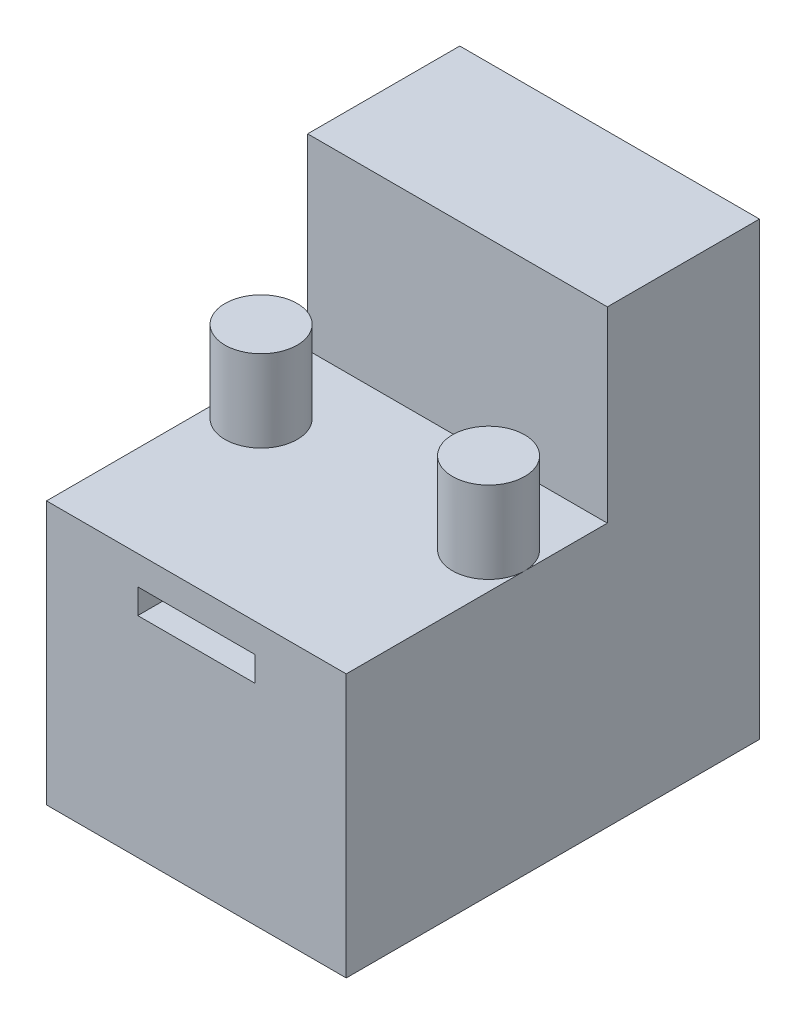
ISO-10303-21;
HEADER;
FILE_DESCRIPTION(('STEP AP214'),'2;1');
FILE_NAME('part.step','',(''),(''),'','','');
FILE_SCHEMA(('AUTOMOTIVE_DESIGN { 1 0 10303 214 1 1 1 1 }'));
ENDSEC;
DATA;
#1=APPLICATION_CONTEXT('core data for automotive mechanical design processes');
#2=APPLICATION_PROTOCOL_DEFINITION('international standard','automotive_design',2000,#1);
#3=PRODUCT_CONTEXT('',#1,'mechanical');
#4=PRODUCT('Part','Part','',(#3));
#5=PRODUCT_RELATED_PRODUCT_CATEGORY('part','',(#4));
#6=PRODUCT_DEFINITION_FORMATION('','',#4);
#7=PRODUCT_DEFINITION_CONTEXT('part definition',#1,'design');
#8=PRODUCT_DEFINITION('design','',#6,#7);
#9=PRODUCT_DEFINITION_SHAPE('','',#8);
#10=(LENGTH_UNIT() NAMED_UNIT(*) SI_UNIT(.MILLI.,.METRE.));
#11=(NAMED_UNIT(*) PLANE_ANGLE_UNIT() SI_UNIT($,.RADIAN.));
#12=(NAMED_UNIT(*) SI_UNIT($,.STERADIAN.) SOLID_ANGLE_UNIT());
#13=UNCERTAINTY_MEASURE_WITH_UNIT(LENGTH_MEASURE(1.E-05),#10,'distance_accuracy_value','');
#14=(GEOMETRIC_REPRESENTATION_CONTEXT(3) GLOBAL_UNCERTAINTY_ASSIGNED_CONTEXT((#13)) GLOBAL_UNIT_ASSIGNED_CONTEXT((#10,
#11,#12)) REPRESENTATION_CONTEXT('',''));
#15=CARTESIAN_POINT('',(0.,0.,0.));
#16=DIRECTION('',(0.,0.,1.));
#17=DIRECTION('',(1.,0.,0.));
#18=AXIS2_PLACEMENT_3D('',#15,#16,#17);
#19=CARTESIAN_POINT('',(0.,11.6,0.));
#20=DIRECTION('',(0.,1.,0.));
#21=DIRECTION('',(0.,0.,1.));
#22=AXIS2_PLACEMENT_3D('',#19,#20,#21);
#23=PLANE('',#22);
#24=DIRECTION('',(0.,0.,-1.));
#25=VECTOR('',#24,1.);
#26=CARTESIAN_POINT('',(6.6,11.6,-9.1));
#27=LINE('',#26,#25);
#28=CARTESIAN_POINT('',(6.6,11.6,1.24));
#29=VERTEX_POINT('',#28);
#30=CARTESIAN_POINT('',(6.6,11.6,-2.4));
#31=VERTEX_POINT('',#30);
#32=EDGE_CURVE('E188',#29,#31,#27,.T.);
#33=ORIENTED_EDGE('',*,*,#32,.T.);
#34=DIRECTION('',(1.,0.,0.));
#35=VECTOR('',#34,1.);
#36=CARTESIAN_POINT('',(-6.6,11.6,-2.4));
#37=LINE('',#36,#35);
#38=CARTESIAN_POINT('',(-6.6,11.6,-2.4));
#39=VERTEX_POINT('',#38);
#40=EDGE_CURVE('E56',#39,#31,#37,.T.);
#41=ORIENTED_EDGE('',*,*,#40,.F.);
#42=DIRECTION('',(0.,0.,1.));
#43=VECTOR('',#42,1.);
#44=CARTESIAN_POINT('',(-6.6,11.6,-9.1));
#45=LINE('',#44,#43);
#46=CARTESIAN_POINT('',(-6.6,11.6,1.24));
#47=VERTEX_POINT('',#46);
#48=EDGE_CURVE('E189',#39,#47,#45,.T.);
#49=ORIENTED_EDGE('',*,*,#48,.T.);
#50=CARTESIAN_POINT('',(-5.01,11.6,1.24));
#51=DIRECTION('',(0.,1.,0.));
#52=DIRECTION('',(0.,0.,1.));
#53=AXIS2_PLACEMENT_3D('',#50,#51,#52);
#54=CIRCLE('',#53,1.59);
#55=EDGE_CURVE('E176',#47,#47,#54,.T.);
#56=ORIENTED_EDGE('',*,*,#55,.F.);
#57=CARTESIAN_POINT('',(-6.6,11.6,9.1));
#58=VERTEX_POINT('',#57);
#59=EDGE_CURVE('E187',#47,#58,#45,.T.);
#60=ORIENTED_EDGE('',*,*,#59,.T.);
#61=DIRECTION('',(1.,0.,0.));
#62=VECTOR('',#61,1.);
#63=CARTESIAN_POINT('',(-6.6,11.6,9.1));
#64=LINE('',#63,#62);
#65=CARTESIAN_POINT('',(6.6,11.6,9.1));
#66=VERTEX_POINT('',#65);
#67=EDGE_CURVE('E191',#58,#66,#64,.T.);
#68=ORIENTED_EDGE('',*,*,#67,.T.);
#69=EDGE_CURVE('E185',#66,#29,#27,.T.);
#70=ORIENTED_EDGE('',*,*,#69,.T.);
#71=CARTESIAN_POINT('',(5.01,11.6,1.24));
#72=DIRECTION('',(0.,-1.,0.));
#73=DIRECTION('',(0.,0.,1.));
#74=AXIS2_PLACEMENT_3D('',#71,#72,#73);
#75=CIRCLE('',#74,1.59);
#76=EDGE_CURVE('E172',#29,#29,#75,.T.);
#77=ORIENTED_EDGE('',*,*,#76,.T.);
#78=EDGE_LOOP('',(#33,#41,#49,#56,#60,#68,#70,#77));
#79=FACE_BOUND('',#78,.T.);
#80=ADVANCED_FACE('F33',(#79),#23,.T.);
#81=CARTESIAN_POINT('',(6.6,11.6,-9.1));
#82=DIRECTION('',(-1.,0.,0.));
#83=DIRECTION('',(0.,0.,1.));
#84=AXIS2_PLACEMENT_3D('',#81,#82,#83);
#85=PLANE('',#84);
#86=DIRECTION('',(0.,0.,-1.));
#87=VECTOR('',#86,1.);
#88=CARTESIAN_POINT('',(6.6,0.,-9.1));
#89=LINE('',#88,#87);
#90=CARTESIAN_POINT('',(6.6,0.,9.1));
#91=VERTEX_POINT('',#90);
#92=CARTESIAN_POINT('',(6.6,0.,-9.1));
#93=VERTEX_POINT('',#92);
#94=EDGE_CURVE('E182',#91,#93,#89,.T.);
#95=ORIENTED_EDGE('',*,*,#94,.T.);
#96=DIRECTION('',(0.,-1.,0.));
#97=VECTOR('',#96,1.);
#98=CARTESIAN_POINT('',(6.6,11.6,-9.1));
#99=LINE('',#98,#97);
#100=CARTESIAN_POINT('',(6.6,19.85,-9.1));
#101=VERTEX_POINT('',#100);
#102=EDGE_CURVE('E11',#101,#93,#99,.T.);
#103=ORIENTED_EDGE('',*,*,#102,.F.);
#104=DIRECTION('',(0.,0.,-1.));
#105=VECTOR('',#104,1.);
#106=CARTESIAN_POINT('',(6.6,19.85,-9.1));
#107=LINE('',#106,#105);
#108=CARTESIAN_POINT('',(6.6,19.85,-2.4));
#109=VERTEX_POINT('',#108);
#110=EDGE_CURVE('E159',#109,#101,#107,.T.);
#111=ORIENTED_EDGE('',*,*,#110,.F.);
#112=DIRECTION('',(0.,-1.,0.));
#113=VECTOR('',#112,1.);
#114=CARTESIAN_POINT('',(6.6,19.85,-2.4));
#115=LINE('',#114,#113);
#116=EDGE_CURVE('E165',#109,#31,#115,.T.);
#117=ORIENTED_EDGE('',*,*,#116,.T.);
#118=ORIENTED_EDGE('',*,*,#32,.F.);
#119=ORIENTED_EDGE('',*,*,#69,.F.);
#120=DIRECTION('',(0.,-1.,0.));
#121=VECTOR('',#120,1.);
#122=CARTESIAN_POINT('',(6.6,11.6,9.1));
#123=LINE('',#122,#121);
#124=EDGE_CURVE('E193',#66,#91,#123,.T.);
#125=ORIENTED_EDGE('',*,*,#124,.T.);
#126=EDGE_LOOP('',(#95,#103,#111,#117,#118,#119,#125));
#127=FACE_BOUND('',#126,.T.);
#128=ADVANCED_FACE('F35',(#127),#85,.F.);
#129=CARTESIAN_POINT('',(-6.6,11.6,-9.1));
#130=DIRECTION('',(0.,0.,1.));
#131=DIRECTION('',(1.,0.,0.));
#132=AXIS2_PLACEMENT_3D('',#129,#130,#131);
#133=PLANE('',#132);
#134=DIRECTION('',(-1.,0.,0.));
#135=VECTOR('',#134,1.);
#136=CARTESIAN_POINT('',(-6.6,0.,-9.1));
#137=LINE('',#136,#135);
#138=CARTESIAN_POINT('',(-6.6,0.,-9.1));
#139=VERTEX_POINT('',#138);
#140=EDGE_CURVE('E196',#93,#139,#137,.T.);
#141=ORIENTED_EDGE('',*,*,#140,.T.);
#142=DIRECTION('',(0.,-1.,0.));
#143=VECTOR('',#142,1.);
#144=CARTESIAN_POINT('',(-6.6,11.6,-9.1));
#145=LINE('',#144,#143);
#146=CARTESIAN_POINT('',(-6.6,19.85,-9.1));
#147=VERTEX_POINT('',#146);
#148=EDGE_CURVE('E41',#147,#139,#145,.T.);
#149=ORIENTED_EDGE('',*,*,#148,.F.);
#150=DIRECTION('',(-1.,0.,0.));
#151=VECTOR('',#150,1.);
#152=CARTESIAN_POINT('',(-6.6,19.85,-9.1));
#153=LINE('',#152,#151);
#154=EDGE_CURVE('E162',#101,#147,#153,.T.);
#155=ORIENTED_EDGE('',*,*,#154,.F.);
#156=ORIENTED_EDGE('',*,*,#102,.T.);
#157=EDGE_LOOP('',(#141,#149,#155,#156));
#158=FACE_BOUND('',#157,.T.);
#159=ADVANCED_FACE('F235',(#158),#133,.F.);
#160=CARTESIAN_POINT('',(-6.6,11.6,-9.1));
#161=DIRECTION('',(1.,0.,0.));
#162=DIRECTION('',(0.,0.,-1.));
#163=AXIS2_PLACEMENT_3D('',#160,#161,#162);
#164=PLANE('',#163);
#165=DIRECTION('',(0.,0.,1.));
#166=VECTOR('',#165,1.);
#167=CARTESIAN_POINT('',(-6.6,0.,-9.1));
#168=LINE('',#167,#166);
#169=CARTESIAN_POINT('',(-6.6,0.,9.1));
#170=VERTEX_POINT('',#169);
#171=EDGE_CURVE('E198',#139,#170,#168,.T.);
#172=ORIENTED_EDGE('',*,*,#171,.T.);
#173=DIRECTION('',(0.,-1.,0.));
#174=VECTOR('',#173,1.);
#175=CARTESIAN_POINT('',(-6.6,11.6,9.1));
#176=LINE('',#175,#174);
#177=EDGE_CURVE('E204',#58,#170,#176,.T.);
#178=ORIENTED_EDGE('',*,*,#177,.F.);
#179=ORIENTED_EDGE('',*,*,#59,.F.);
#180=ORIENTED_EDGE('',*,*,#48,.F.);
#181=DIRECTION('',(0.,-1.,0.));
#182=VECTOR('',#181,1.);
#183=CARTESIAN_POINT('',(-6.6,19.85,-2.4));
#184=LINE('',#183,#182);
#185=CARTESIAN_POINT('',(-6.6,19.85,-2.4));
#186=VERTEX_POINT('',#185);
#187=EDGE_CURVE('E169',#186,#39,#184,.T.);
#188=ORIENTED_EDGE('',*,*,#187,.F.);
#189=DIRECTION('',(0.,0.,1.));
#190=VECTOR('',#189,1.);
#191=CARTESIAN_POINT('',(-6.6,19.85,-9.1));
#192=LINE('',#191,#190);
#193=EDGE_CURVE('E154',#147,#186,#192,.T.);
#194=ORIENTED_EDGE('',*,*,#193,.F.);
#195=ORIENTED_EDGE('',*,*,#148,.T.);
#196=EDGE_LOOP('',(#172,#178,#179,#180,#188,#194,#195));
#197=FACE_BOUND('',#196,.T.);
#198=ADVANCED_FACE('F210',(#197),#164,.F.);
#199=CARTESIAN_POINT('',(-6.6,11.6,9.1));
#200=DIRECTION('',(0.,0.,-1.));
#201=DIRECTION('',(-1.,0.,0.));
#202=AXIS2_PLACEMENT_3D('',#199,#200,#201);
#203=PLANE('',#202);
#204=DIRECTION('',(-1.,0.,0.));
#205=VECTOR('',#204,1.);
#206=CARTESIAN_POINT('',(-2.58247902352881,10.3289631992113,9.1));
#207=LINE('',#206,#205);
#208=CARTESIAN_POINT('',(2.58247902352882,10.3289631992113,9.1));
#209=VERTEX_POINT('',#208);
#210=CARTESIAN_POINT('',(-2.58247902352881,10.3289631992113,9.1));
#211=VERTEX_POINT('',#210);
#212=EDGE_CURVE('E145',#209,#211,#207,.T.);
#213=ORIENTED_EDGE('',*,*,#212,.F.);
#214=DIRECTION('',(0.,1.,0.));
#215=VECTOR('',#214,1.);
#216=CARTESIAN_POINT('',(2.58247902352882,9.23249165849513,9.1));
#217=LINE('',#216,#215);
#218=CARTESIAN_POINT('',(2.58247902352882,9.23249165849513,9.1));
#219=VERTEX_POINT('',#218);
#220=EDGE_CURVE('E48',#219,#209,#217,.T.);
#221=ORIENTED_EDGE('',*,*,#220,.F.);
#222=DIRECTION('',(1.,0.,0.));
#223=VECTOR('',#222,1.);
#224=CARTESIAN_POINT('',(-2.58247902352881,9.23249165849513,9.1));
#225=LINE('',#224,#223);
#226=CARTESIAN_POINT('',(-2.58247902352881,9.23249165849513,9.1));
#227=VERTEX_POINT('',#226);
#228=EDGE_CURVE('E136',#227,#219,#225,.T.);
#229=ORIENTED_EDGE('',*,*,#228,.F.);
#230=DIRECTION('',(0.,-1.,0.));
#231=VECTOR('',#230,1.);
#232=CARTESIAN_POINT('',(-2.58247902352881,9.23249165849513,9.1));
#233=LINE('',#232,#231);
#234=EDGE_CURVE('E139',#211,#227,#233,.T.);
#235=ORIENTED_EDGE('',*,*,#234,.F.);
#236=EDGE_LOOP('',(#213,#221,#229,#235));
#237=FACE_BOUND('',#236,.T.);
#238=DIRECTION('',(1.,0.,0.));
#239=VECTOR('',#238,1.);
#240=CARTESIAN_POINT('',(-6.6,0.,9.1));
#241=LINE('',#240,#239);
#242=EDGE_CURVE('E200',#170,#91,#241,.T.);
#243=ORIENTED_EDGE('',*,*,#242,.T.);
#244=ORIENTED_EDGE('',*,*,#124,.F.);
#245=ORIENTED_EDGE('',*,*,#67,.F.);
#246=ORIENTED_EDGE('',*,*,#177,.T.);
#247=EDGE_LOOP('',(#243,#244,#245,#246));
#248=FACE_BOUND('',#247,.T.);
#249=ADVANCED_FACE('F221',(#237,#248),#203,.F.);
#250=CARTESIAN_POINT('',(0.,0.,0.));
#251=DIRECTION('',(0.,1.,0.));
#252=DIRECTION('',(0.,0.,1.));
#253=AXIS2_PLACEMENT_3D('',#250,#251,#252);
#254=PLANE('',#253);
#255=ORIENTED_EDGE('',*,*,#94,.F.);
#256=ORIENTED_EDGE('',*,*,#242,.F.);
#257=ORIENTED_EDGE('',*,*,#171,.F.);
#258=ORIENTED_EDGE('',*,*,#140,.F.);
#259=EDGE_LOOP('',(#255,#256,#257,#258));
#260=FACE_BOUND('',#259,.T.);
#261=ADVANCED_FACE('F218',(#260),#254,.F.);
#262=CARTESIAN_POINT('',(-5.01,15.2,1.24));
#263=DIRECTION('',(0.,-1.,0.));
#264=DIRECTION('',(0.,0.,-1.));
#265=AXIS2_PLACEMENT_3D('',#262,#263,#264);
#266=CYLINDRICAL_SURFACE('',#265,1.59);
#267=CARTESIAN_POINT('',(-5.01,15.2,1.24));
#268=DIRECTION('',(0.,1.,0.));
#269=DIRECTION('',(0.,0.,1.));
#270=AXIS2_PLACEMENT_3D('',#267,#268,#269);
#271=CIRCLE('',#270,1.59);
#272=CARTESIAN_POINT('',(-5.01,15.2,2.83));
#273=VERTEX_POINT('',#272);
#274=EDGE_CURVE('E179',#273,#273,#271,.T.);
#275=ORIENTED_EDGE('',*,*,#274,.F.);
#276=EDGE_LOOP('',(#275));
#277=FACE_BOUND('',#276,.T.);
#278=ORIENTED_EDGE('',*,*,#55,.T.);
#279=EDGE_LOOP('',(#278));
#280=FACE_BOUND('',#279,.T.);
#281=ADVANCED_FACE('F248',(#277,#280),#266,.T.);
#282=CARTESIAN_POINT('',(-5.01,15.2,1.24));
#283=DIRECTION('',(0.,1.,0.));
#284=DIRECTION('',(0.,0.,1.));
#285=AXIS2_PLACEMENT_3D('',#282,#283,#284);
#286=PLANE('',#285);
#287=ORIENTED_EDGE('',*,*,#274,.T.);
#288=EDGE_LOOP('',(#287));
#289=FACE_BOUND('',#288,.T.);
#290=ADVANCED_FACE('F286',(#289),#286,.T.);
#291=CARTESIAN_POINT('',(5.01,15.2,1.24));
#292=DIRECTION('',(0.,-1.,0.));
#293=DIRECTION('',(0.,0.,-1.));
#294=AXIS2_PLACEMENT_3D('',#291,#292,#293);
#295=CYLINDRICAL_SURFACE('',#294,1.59);
#296=CARTESIAN_POINT('',(5.01,15.2,1.24));
#297=DIRECTION('',(0.,-1.,0.));
#298=DIRECTION('',(0.,0.,1.));
#299=AXIS2_PLACEMENT_3D('',#296,#297,#298);
#300=CIRCLE('',#299,1.59);
#301=CARTESIAN_POINT('',(5.01,15.2,2.83));
#302=VERTEX_POINT('',#301);
#303=EDGE_CURVE('E173',#302,#302,#300,.T.);
#304=ORIENTED_EDGE('',*,*,#303,.T.);
#305=EDGE_LOOP('',(#304));
#306=FACE_BOUND('',#305,.T.);
#307=ORIENTED_EDGE('',*,*,#76,.F.);
#308=EDGE_LOOP('',(#307));
#309=FACE_BOUND('',#308,.T.);
#310=ADVANCED_FACE('F283',(#306,#309),#295,.T.);
#311=CARTESIAN_POINT('',(5.01,15.2,1.24));
#312=DIRECTION('',(0.,1.,0.));
#313=DIRECTION('',(0.,0.,1.));
#314=AXIS2_PLACEMENT_3D('',#311,#312,#313);
#315=PLANE('',#314);
#316=ORIENTED_EDGE('',*,*,#303,.F.);
#317=EDGE_LOOP('',(#316));
#318=FACE_BOUND('',#317,.T.);
#319=ADVANCED_FACE('F280',(#318),#315,.T.);
#320=CARTESIAN_POINT('',(-6.6,19.85,-2.4));
#321=DIRECTION('',(0.,0.,-1.));
#322=DIRECTION('',(-1.,0.,0.));
#323=AXIS2_PLACEMENT_3D('',#320,#321,#322);
#324=PLANE('',#323);
#325=ORIENTED_EDGE('',*,*,#40,.T.);
#326=ORIENTED_EDGE('',*,*,#116,.F.);
#327=DIRECTION('',(1.,0.,0.));
#328=VECTOR('',#327,1.);
#329=CARTESIAN_POINT('',(-6.6,19.85,-2.4));
#330=LINE('',#329,#328);
#331=EDGE_CURVE('E157',#186,#109,#330,.T.);
#332=ORIENTED_EDGE('',*,*,#331,.F.);
#333=ORIENTED_EDGE('',*,*,#187,.T.);
#334=EDGE_LOOP('',(#325,#326,#332,#333));
#335=FACE_BOUND('',#334,.T.);
#336=ADVANCED_FACE('F230',(#335),#324,.F.);
#337=CARTESIAN_POINT('',(0.,19.85,0.));
#338=DIRECTION('',(0.,1.,0.));
#339=DIRECTION('',(0.,0.,1.));
#340=AXIS2_PLACEMENT_3D('',#337,#338,#339);
#341=PLANE('',#340);
#342=ORIENTED_EDGE('',*,*,#193,.T.);
#343=ORIENTED_EDGE('',*,*,#331,.T.);
#344=ORIENTED_EDGE('',*,*,#110,.T.);
#345=ORIENTED_EDGE('',*,*,#154,.T.);
#346=EDGE_LOOP('',(#342,#343,#344,#345));
#347=FACE_BOUND('',#346,.T.);
#348=ADVANCED_FACE('F234',(#347),#341,.T.);
#349=CARTESIAN_POINT('',(2.58247902352882,9.23249165849513,4.1));
#350=DIRECTION('',(1.,0.,0.));
#351=DIRECTION('',(0.,0.,-1.));
#352=AXIS2_PLACEMENT_3D('',#349,#350,#351);
#353=PLANE('',#352);
#354=ORIENTED_EDGE('',*,*,#220,.T.);
#355=DIRECTION('',(0.,0.,1.));
#356=VECTOR('',#355,1.);
#357=CARTESIAN_POINT('',(2.58247902352882,10.3289631992113,4.1));
#358=LINE('',#357,#356);
#359=CARTESIAN_POINT('',(2.58247902352882,10.3289631992113,4.1));
#360=VERTEX_POINT('',#359);
#361=EDGE_CURVE('E114',#360,#209,#358,.T.);
#362=ORIENTED_EDGE('',*,*,#361,.F.);
#363=DIRECTION('',(0.,1.,0.));
#364=VECTOR('',#363,1.);
#365=CARTESIAN_POINT('',(2.58247902352882,9.23249165849513,4.1));
#366=LINE('',#365,#364);
#367=CARTESIAN_POINT('',(2.58247902352882,9.23249165849513,4.1));
#368=VERTEX_POINT('',#367);
#369=EDGE_CURVE('E118',#368,#360,#366,.T.);
#370=ORIENTED_EDGE('',*,*,#369,.F.);
#371=DIRECTION('',(0.,0.,1.));
#372=VECTOR('',#371,1.);
#373=CARTESIAN_POINT('',(2.58247902352882,9.23249165849513,4.1));
#374=LINE('',#373,#372);
#375=EDGE_CURVE('E149',#368,#219,#374,.T.);
#376=ORIENTED_EDGE('',*,*,#375,.T.);
#377=EDGE_LOOP('',(#354,#362,#370,#376));
#378=FACE_BOUND('',#377,.T.);
#379=ADVANCED_FACE('F116',(#378),#353,.F.);
#380=CARTESIAN_POINT('',(-2.58247902352881,9.23249165849513,4.1));
#381=DIRECTION('',(0.,-1.,0.));
#382=DIRECTION('',(0.,0.,-1.));
#383=AXIS2_PLACEMENT_3D('',#380,#381,#382);
#384=PLANE('',#383);
#385=ORIENTED_EDGE('',*,*,#228,.T.);
#386=ORIENTED_EDGE('',*,*,#375,.F.);
#387=DIRECTION('',(1.,0.,0.));
#388=VECTOR('',#387,1.);
#389=CARTESIAN_POINT('',(-2.58247902352881,9.23249165849513,4.1));
#390=LINE('',#389,#388);
#391=CARTESIAN_POINT('',(-2.58247902352881,9.23249165849513,4.1));
#392=VERTEX_POINT('',#391);
#393=EDGE_CURVE('E124',#392,#368,#390,.T.);
#394=ORIENTED_EDGE('',*,*,#393,.F.);
#395=DIRECTION('',(0.,0.,1.));
#396=VECTOR('',#395,1.);
#397=CARTESIAN_POINT('',(-2.58247902352881,9.23249165849513,4.1));
#398=LINE('',#397,#396);
#399=EDGE_CURVE('E151',#392,#227,#398,.T.);
#400=ORIENTED_EDGE('',*,*,#399,.T.);
#401=EDGE_LOOP('',(#385,#386,#394,#400));
#402=FACE_BOUND('',#401,.T.);
#403=ADVANCED_FACE('F263',(#402),#384,.F.);
#404=CARTESIAN_POINT('',(-2.58247902352881,9.23249165849513,4.1));
#405=DIRECTION('',(-1.,0.,0.));
#406=DIRECTION('',(0.,0.,1.));
#407=AXIS2_PLACEMENT_3D('',#404,#405,#406);
#408=PLANE('',#407);
#409=ORIENTED_EDGE('',*,*,#234,.T.);
#410=ORIENTED_EDGE('',*,*,#399,.F.);
#411=DIRECTION('',(0.,-1.,0.));
#412=VECTOR('',#411,1.);
#413=CARTESIAN_POINT('',(-2.58247902352881,9.23249165849513,4.1));
#414=LINE('',#413,#412);
#415=CARTESIAN_POINT('',(-2.58247902352881,10.3289631992113,4.1));
#416=VERTEX_POINT('',#415);
#417=EDGE_CURVE('E132',#416,#392,#414,.T.);
#418=ORIENTED_EDGE('',*,*,#417,.F.);
#419=DIRECTION('',(0.,0.,1.));
#420=VECTOR('',#419,1.);
#421=CARTESIAN_POINT('',(-2.58247902352881,10.3289631992113,4.1));
#422=LINE('',#421,#420);
#423=EDGE_CURVE('E123',#416,#211,#422,.T.);
#424=ORIENTED_EDGE('',*,*,#423,.T.);
#425=EDGE_LOOP('',(#409,#410,#418,#424));
#426=FACE_BOUND('',#425,.T.);
#427=ADVANCED_FACE('F261',(#426),#408,.F.);
#428=CARTESIAN_POINT('',(-2.58247902352881,10.3289631992113,4.1));
#429=DIRECTION('',(0.,1.,0.));
#430=DIRECTION('',(0.,0.,1.));
#431=AXIS2_PLACEMENT_3D('',#428,#429,#430);
#432=PLANE('',#431);
#433=ORIENTED_EDGE('',*,*,#212,.T.);
#434=ORIENTED_EDGE('',*,*,#423,.F.);
#435=DIRECTION('',(-1.,0.,0.));
#436=VECTOR('',#435,1.);
#437=CARTESIAN_POINT('',(-2.58247902352881,10.3289631992113,4.1));
#438=LINE('',#437,#436);
#439=EDGE_CURVE('E127',#360,#416,#438,.T.);
#440=ORIENTED_EDGE('',*,*,#439,.F.);
#441=ORIENTED_EDGE('',*,*,#361,.T.);
#442=EDGE_LOOP('',(#433,#434,#440,#441));
#443=FACE_BOUND('',#442,.T.);
#444=ADVANCED_FACE('F128',(#443),#432,.F.);
#445=CARTESIAN_POINT('',(0.,0.,4.1));
#446=DIRECTION('',(0.,0.,-1.));
#447=DIRECTION('',(-1.,0.,0.));
#448=AXIS2_PLACEMENT_3D('',#445,#446,#447);
#449=PLANE('',#448);
#450=ORIENTED_EDGE('',*,*,#369,.T.);
#451=ORIENTED_EDGE('',*,*,#439,.T.);
#452=ORIENTED_EDGE('',*,*,#417,.T.);
#453=ORIENTED_EDGE('',*,*,#393,.T.);
#454=EDGE_LOOP('',(#450,#451,#452,#453));
#455=FACE_BOUND('',#454,.T.);
#456=ADVANCED_FACE('F134',(#455),#449,.F.);
#457=CLOSED_SHELL('',(#80,#128,#159,#198,#249,#261,#281,#290,#310,#319,#336,#348,#379,#403,#427,
#444,#456));
#458=MANIFOLD_SOLID_BREP('B2',#457);
#459=ADVANCED_BREP_SHAPE_REPRESENTATION('',(#18,#458),#14);
#460=SHAPE_DEFINITION_REPRESENTATION(#9,#459);
ENDSEC;
END-ISO-10303-21;
